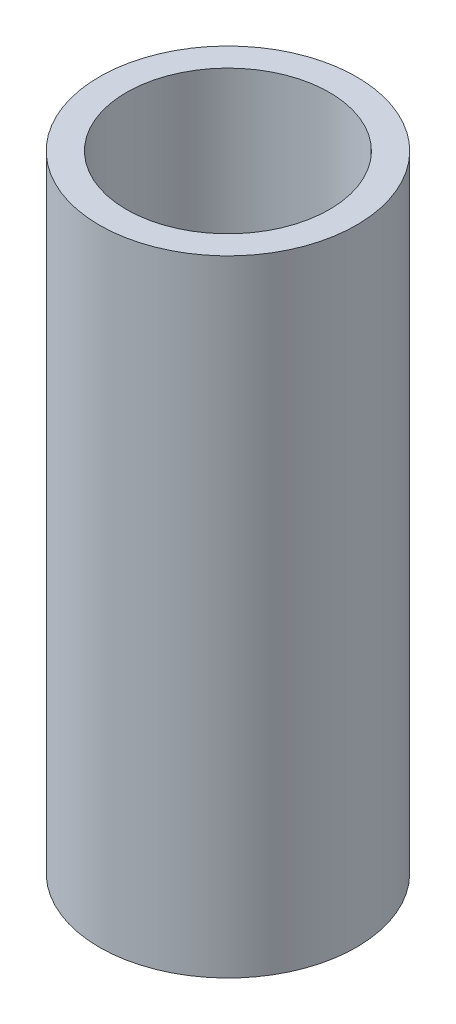
ISO-10303-21;
HEADER;
FILE_DESCRIPTION(('STEP AP214'),'2;1');
FILE_NAME('part.step','',(''),(''),'','','');
FILE_SCHEMA(('AUTOMOTIVE_DESIGN { 1 0 10303 214 1 1 1 1 }'));
ENDSEC;
DATA;
#1=APPLICATION_CONTEXT('core data for automotive mechanical design processes');
#2=APPLICATION_PROTOCOL_DEFINITION('international standard','automotive_design',2000,#1);
#3=PRODUCT_CONTEXT('',#1,'mechanical');
#4=PRODUCT('Part','Part','',(#3));
#5=PRODUCT_RELATED_PRODUCT_CATEGORY('part','',(#4));
#6=PRODUCT_DEFINITION_FORMATION('','',#4);
#7=PRODUCT_DEFINITION_CONTEXT('part definition',#1,'design');
#8=PRODUCT_DEFINITION('design','',#6,#7);
#9=PRODUCT_DEFINITION_SHAPE('','',#8);
#10=(LENGTH_UNIT() NAMED_UNIT(*) SI_UNIT(.MILLI.,.METRE.));
#11=(NAMED_UNIT(*) PLANE_ANGLE_UNIT() SI_UNIT($,.RADIAN.));
#12=(NAMED_UNIT(*) SI_UNIT($,.STERADIAN.) SOLID_ANGLE_UNIT());
#13=UNCERTAINTY_MEASURE_WITH_UNIT(LENGTH_MEASURE(1.E-05),#10,'distance_accuracy_value','');
#14=(GEOMETRIC_REPRESENTATION_CONTEXT(3) GLOBAL_UNCERTAINTY_ASSIGNED_CONTEXT((#13)) GLOBAL_UNIT_ASSIGNED_CONTEXT((#10,
#11,#12)) REPRESENTATION_CONTEXT('',''));
#15=CARTESIAN_POINT('',(0.,0.,0.));
#16=DIRECTION('',(0.,0.,1.));
#17=DIRECTION('',(1.,0.,0.));
#18=AXIS2_PLACEMENT_3D('',#15,#16,#17);
#19=CARTESIAN_POINT('',(0.,145.96502500081,0.));
#20=DIRECTION('',(0.,-1.,0.));
#21=DIRECTION('',(0.,0.,-1.));
#22=AXIS2_PLACEMENT_3D('',#19,#20,#21);
#23=CYLINDRICAL_SURFACE('',#22,30.);
#24=CARTESIAN_POINT('',(0.,145.96502500081,0.));
#25=DIRECTION('',(0.,1.,0.));
#26=DIRECTION('',(0.,0.,1.));
#27=AXIS2_PLACEMENT_3D('',#24,#25,#26);
#28=CIRCLE('',#27,30.);
#29=CARTESIAN_POINT('',(0.,145.96502500081,30.));
#30=VERTEX_POINT('',#29);
#31=EDGE_CURVE('E10',#30,#30,#28,.T.);
#32=ORIENTED_EDGE('',*,*,#31,.F.);
#33=EDGE_LOOP('',(#32));
#34=FACE_BOUND('',#33,.T.);
#35=CARTESIAN_POINT('',(0.,0.,0.));
#36=DIRECTION('',(0.,1.,0.));
#37=DIRECTION('',(0.,0.,1.));
#38=AXIS2_PLACEMENT_3D('',#35,#36,#37);
#39=CIRCLE('',#38,30.);
#40=CARTESIAN_POINT('',(0.,0.,30.));
#41=VERTEX_POINT('',#40);
#42=EDGE_CURVE('E37',#41,#41,#39,.T.);
#43=ORIENTED_EDGE('',*,*,#42,.T.);
#44=EDGE_LOOP('',(#43));
#45=FACE_BOUND('',#44,.T.);
#46=ADVANCED_FACE('F40',(#34,#45),#23,.T.);
#47=CARTESIAN_POINT('',(0.,145.96502500081,0.));
#48=DIRECTION('',(0.,1.,0.));
#49=DIRECTION('',(0.,0.,1.));
#50=AXIS2_PLACEMENT_3D('',#47,#48,#49);
#51=PLANE('',#50);
#52=CARTESIAN_POINT('',(0.,145.96502500081,0.));
#53=DIRECTION('',(0.,1.,0.));
#54=DIRECTION('',(0.,0.,1.));
#55=AXIS2_PLACEMENT_3D('',#52,#53,#54);
#56=CIRCLE('',#55,23.6876318374483);
#57=CARTESIAN_POINT('',(0.,145.96502500081,23.6876318374483));
#58=VERTEX_POINT('',#57);
#59=EDGE_CURVE('E50',#58,#58,#56,.T.);
#60=ORIENTED_EDGE('',*,*,#59,.F.);
#61=EDGE_LOOP('',(#60));
#62=FACE_BOUND('',#61,.T.);
#63=ORIENTED_EDGE('',*,*,#31,.T.);
#64=EDGE_LOOP('',(#63));
#65=FACE_BOUND('',#64,.T.);
#66=ADVANCED_FACE('F59',(#62,#65),#51,.T.);
#67=CARTESIAN_POINT('',(0.,0.,0.));
#68=DIRECTION('',(0.,1.,0.));
#69=DIRECTION('',(0.,0.,1.));
#70=AXIS2_PLACEMENT_3D('',#67,#68,#69);
#71=PLANE('',#70);
#72=CARTESIAN_POINT('',(0.,0.,0.));
#73=DIRECTION('',(0.,1.,0.));
#74=DIRECTION('',(0.,0.,1.));
#75=AXIS2_PLACEMENT_3D('',#72,#73,#74);
#76=CIRCLE('',#75,23.6876318374483);
#77=CARTESIAN_POINT('',(0.,0.,23.6876318374483));
#78=VERTEX_POINT('',#77);
#79=EDGE_CURVE('E47',#78,#78,#76,.T.);
#80=ORIENTED_EDGE('',*,*,#79,.T.);
#81=EDGE_LOOP('',(#80));
#82=FACE_BOUND('',#81,.T.);
#83=ORIENTED_EDGE('',*,*,#42,.F.);
#84=EDGE_LOOP('',(#83));
#85=FACE_BOUND('',#84,.T.);
#86=ADVANCED_FACE('F58',(#82,#85),#71,.F.);
#87=CARTESIAN_POINT('',(0.,145.96502500081,0.));
#88=DIRECTION('',(0.,-1.,0.));
#89=DIRECTION('',(0.,0.,-1.));
#90=AXIS2_PLACEMENT_3D('',#87,#88,#89);
#91=CYLINDRICAL_SURFACE('',#90,23.6876318374483);
#92=ORIENTED_EDGE('',*,*,#59,.T.);
#93=EDGE_LOOP('',(#92));
#94=FACE_BOUND('',#93,.T.);
#95=ORIENTED_EDGE('',*,*,#79,.F.);
#96=EDGE_LOOP('',(#95));
#97=FACE_BOUND('',#96,.T.);
#98=ADVANCED_FACE('F54',(#94,#97),#91,.F.);
#99=CLOSED_SHELL('',(#46,#66,#86,#98));
#100=MANIFOLD_SOLID_BREP('B2',#99);
#101=ADVANCED_BREP_SHAPE_REPRESENTATION('',(#18,#100),#14);
#102=SHAPE_DEFINITION_REPRESENTATION(#9,#101);
ENDSEC;
END-ISO-10303-21;
